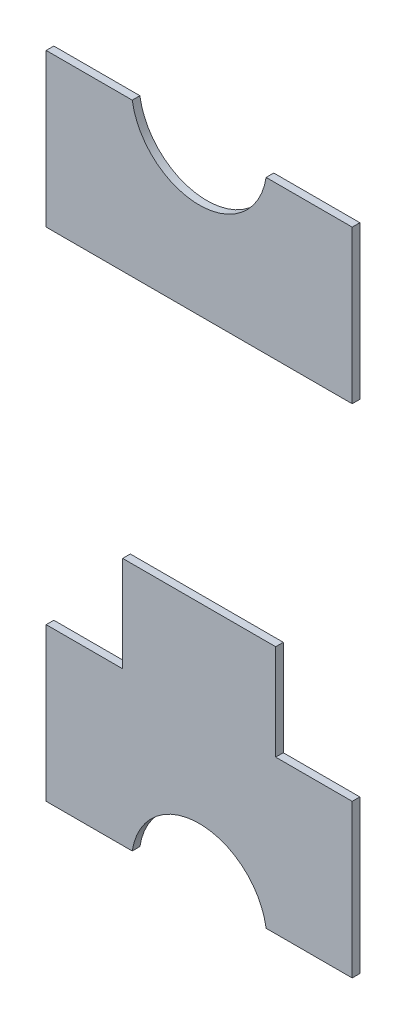
ISO-10303-21;
HEADER;
FILE_DESCRIPTION(('STEP AP214'),'2;1');
FILE_NAME('part.step','',(''),(''),'','','');
FILE_SCHEMA(('AUTOMOTIVE_DESIGN { 1 0 10303 214 1 1 1 1 }'));
ENDSEC;
DATA;
#1=APPLICATION_CONTEXT('core data for automotive mechanical design processes');
#2=APPLICATION_PROTOCOL_DEFINITION('international standard','automotive_design',2000,#1);
#3=PRODUCT_CONTEXT('',#1,'mechanical');
#4=PRODUCT('Part','Part','',(#3));
#5=PRODUCT_RELATED_PRODUCT_CATEGORY('part','',(#4));
#6=PRODUCT_DEFINITION_FORMATION('','',#4);
#7=PRODUCT_DEFINITION_CONTEXT('part definition',#1,'design');
#8=PRODUCT_DEFINITION('design','',#6,#7);
#9=PRODUCT_DEFINITION_SHAPE('','',#8);
#10=(LENGTH_UNIT() NAMED_UNIT(*) SI_UNIT(.MILLI.,.METRE.));
#11=(NAMED_UNIT(*) PLANE_ANGLE_UNIT() SI_UNIT($,.RADIAN.));
#12=(NAMED_UNIT(*) SI_UNIT($,.STERADIAN.) SOLID_ANGLE_UNIT());
#13=UNCERTAINTY_MEASURE_WITH_UNIT(LENGTH_MEASURE(1.E-05),#10,'distance_accuracy_value','');
#14=(GEOMETRIC_REPRESENTATION_CONTEXT(3) GLOBAL_UNCERTAINTY_ASSIGNED_CONTEXT((#13)) GLOBAL_UNIT_ASSIGNED_CONTEXT((#10,
#11,#12)) REPRESENTATION_CONTEXT('',''));
#15=CARTESIAN_POINT('',(0.,0.,0.));
#16=DIRECTION('',(0.,0.,1.));
#17=DIRECTION('',(1.,0.,0.));
#18=AXIS2_PLACEMENT_3D('',#15,#16,#17);
#19=CARTESIAN_POINT('',(-0.4,-0.85,0.01999999955297));
#20=DIRECTION('',(0.,0.,1.));
#21=DIRECTION('',(1.,0.,0.));
#22=AXIS2_PLACEMENT_3D('',#19,#20,#21);
#23=PLANE('',#22);
#24=DIRECTION('',(1.,0.,0.));
#25=VECTOR('',#24,1.);
#26=CARTESIAN_POINT('',(-0.2,-0.2,0.01999999955297));
#27=LINE('',#26,#25);
#28=CARTESIAN_POINT('',(-0.2,-0.2,0.01999999955297));
#29=VERTEX_POINT('',#28);
#30=CARTESIAN_POINT('',(0.2,-0.2,0.01999999955297));
#31=VERTEX_POINT('',#30);
#32=EDGE_CURVE('P0_E179',#29,#31,#27,.T.);
#33=ORIENTED_EDGE('',*,*,#32,.F.);
#34=DIRECTION('',(0.,1.,0.));
#35=VECTOR('',#34,1.);
#36=CARTESIAN_POINT('',(-0.2,-0.45,0.01999999955297));
#37=LINE('',#36,#35);
#38=CARTESIAN_POINT('',(-0.2,-0.45,0.01999999955297));
#39=VERTEX_POINT('',#38);
#40=EDGE_CURVE('P0_E172',#39,#29,#37,.T.);
#41=ORIENTED_EDGE('',*,*,#40,.F.);
#42=DIRECTION('',(1.,0.,0.));
#43=VECTOR('',#42,1.);
#44=CARTESIAN_POINT('',(-0.4,-0.45,0.01999999955297));
#45=LINE('',#44,#43);
#46=CARTESIAN_POINT('',(-0.4,-0.45,0.01999999955297));
#47=VERTEX_POINT('',#46);
#48=EDGE_CURVE('P0_E138',#47,#39,#45,.T.);
#49=ORIENTED_EDGE('',*,*,#48,.F.);
#50=DIRECTION('',(0.,1.,0.));
#51=VECTOR('',#50,1.);
#52=CARTESIAN_POINT('',(-0.4,-0.85,0.01999999955297));
#53=LINE('',#52,#51);
#54=CARTESIAN_POINT('',(-0.4,-0.85,0.01999999955297));
#55=VERTEX_POINT('',#54);
#56=EDGE_CURVE('P0_E131',#55,#47,#53,.T.);
#57=ORIENTED_EDGE('',*,*,#56,.F.);
#58=DIRECTION('',(1.,0.,0.));
#59=VECTOR('',#58,1.);
#60=CARTESIAN_POINT('',(-0.175,-0.85,0.01999999955297));
#61=LINE('',#60,#59);
#62=CARTESIAN_POINT('',(-0.174999999999718,-0.850000000000022,0.01999999955297));
#63=VERTEX_POINT('',#62);
#64=EDGE_CURVE('P0_E97',#63,#55,#61,.F.);
#65=ORIENTED_EDGE('',*,*,#64,.F.);
#66=CARTESIAN_POINT('',(0.,-0.877083333333,0.01999999955297));
#67=DIRECTION('',(0.,0.,-1.));
#68=DIRECTION('',(-1.,0.,0.));
#69=AXIS2_PLACEMENT_3D('',#66,#67,#68);
#70=CIRCLE('',#69,0.177083333333);
#71=CARTESIAN_POINT('',(0.174999999999857,-0.85,0.01999999955297));
#72=VERTEX_POINT('',#71);
#73=EDGE_CURVE('P0_E20',#63,#72,#70,.T.);
#74=ORIENTED_EDGE('',*,*,#73,.T.);
#75=DIRECTION('',(1.,0.,0.));
#76=VECTOR('',#75,1.);
#77=CARTESIAN_POINT('',(0.4,-0.85,0.01999999955297));
#78=LINE('',#77,#76);
#79=CARTESIAN_POINT('',(0.4,-0.85,0.01999999955297));
#80=VERTEX_POINT('',#79);
#81=EDGE_CURVE('P0_E94',#80,#72,#78,.F.);
#82=ORIENTED_EDGE('',*,*,#81,.F.);
#83=DIRECTION('',(0.,1.,0.));
#84=VECTOR('',#83,1.);
#85=CARTESIAN_POINT('',(0.4,-0.45,0.01999999955297));
#86=LINE('',#85,#84);
#87=CARTESIAN_POINT('',(0.4,-0.45,0.01999999955297));
#88=VERTEX_POINT('',#87);
#89=EDGE_CURVE('P0_E126',#88,#80,#86,.F.);
#90=ORIENTED_EDGE('',*,*,#89,.F.);
#91=DIRECTION('',(1.,0.,0.));
#92=VECTOR('',#91,1.);
#93=CARTESIAN_POINT('',(0.2,-0.45,0.01999999955297));
#94=LINE('',#93,#92);
#95=CARTESIAN_POINT('',(0.2,-0.45,0.01999999955297));
#96=VERTEX_POINT('',#95);
#97=EDGE_CURVE('P0_E185',#96,#88,#94,.T.);
#98=ORIENTED_EDGE('',*,*,#97,.F.);
#99=DIRECTION('',(0.,1.,0.));
#100=VECTOR('',#99,1.);
#101=CARTESIAN_POINT('',(0.2,-0.2,0.01999999955297));
#102=LINE('',#101,#100);
#103=EDGE_CURVE('P0_E181',#31,#96,#102,.F.);
#104=ORIENTED_EDGE('',*,*,#103,.F.);
#105=EDGE_LOOP('',(#33,#41,#49,#57,#65,#74,#82,#90,#98,#104));
#106=FACE_BOUND('',#105,.T.);
#107=ADVANCED_FACE('P0_F17',(#106),#23,.T.);
#108=CARTESIAN_POINT('',(-0.4,-0.85,0.));
#109=DIRECTION('',(-1.,0.,0.));
#110=DIRECTION('',(0.,0.,1.));
#111=AXIS2_PLACEMENT_3D('',#108,#109,#110);
#112=PLANE('',#111);
#113=DIRECTION('',(0.,0.,-1.));
#114=VECTOR('',#113,1.);
#115=CARTESIAN_POINT('',(-0.4,-0.85,0.));
#116=LINE('',#115,#114);
#117=CARTESIAN_POINT('',(-0.4,-0.85,0.));
#118=VERTEX_POINT('',#117);
#119=EDGE_CURVE('P0_E129',#55,#118,#116,.T.);
#120=ORIENTED_EDGE('',*,*,#119,.F.);
#121=ORIENTED_EDGE('',*,*,#56,.T.);
#122=DIRECTION('',(0.,0.,1.));
#123=VECTOR('',#122,1.);
#124=CARTESIAN_POINT('',(-0.4,-0.45,0.));
#125=LINE('',#124,#123);
#126=CARTESIAN_POINT('',(-0.4,-0.45,0.));
#127=VERTEX_POINT('',#126);
#128=EDGE_CURVE('P0_E141',#127,#47,#125,.T.);
#129=ORIENTED_EDGE('',*,*,#128,.F.);
#130=DIRECTION('',(0.,1.,0.));
#131=VECTOR('',#130,1.);
#132=CARTESIAN_POINT('',(-0.4,-0.85,0.));
#133=LINE('',#132,#131);
#134=EDGE_CURVE('P0_E134',#127,#118,#133,.F.);
#135=ORIENTED_EDGE('',*,*,#134,.T.);
#136=EDGE_LOOP('',(#120,#121,#129,#135));
#137=FACE_BOUND('',#136,.T.);
#138=ADVANCED_FACE('P0_F224',(#137),#112,.T.);
#139=CARTESIAN_POINT('',(-0.175,-0.85,0.));
#140=DIRECTION('',(0.,-1.,0.));
#141=DIRECTION('',(0.,0.,-1.));
#142=AXIS2_PLACEMENT_3D('',#139,#140,#141);
#143=PLANE('',#142);
#144=DIRECTION('',(0.,0.,-1.));
#145=VECTOR('',#144,1.);
#146=CARTESIAN_POINT('',(-0.174999999999721,-0.850000000000043,0.));
#147=LINE('',#146,#145);
#148=CARTESIAN_POINT('',(-0.174999999999718,-0.850000000000022,0.));
#149=VERTEX_POINT('',#148);
#150=EDGE_CURVE('P0_E99',#149,#63,#147,.F.);
#151=ORIENTED_EDGE('',*,*,#150,.T.);
#152=ORIENTED_EDGE('',*,*,#64,.T.);
#153=ORIENTED_EDGE('',*,*,#119,.T.);
#154=DIRECTION('',(1.,0.,0.));
#155=VECTOR('',#154,1.);
#156=CARTESIAN_POINT('',(-0.4,-0.85,0.));
#157=LINE('',#156,#155);
#158=EDGE_CURVE('P0_E137',#118,#149,#157,.T.);
#159=ORIENTED_EDGE('',*,*,#158,.T.);
#160=EDGE_LOOP('',(#151,#152,#153,#159));
#161=FACE_BOUND('',#160,.T.);
#162=ADVANCED_FACE('P0_F225',(#161),#143,.T.);
#163=CARTESIAN_POINT('',(0.,-0.877083333333,0.));
#164=DIRECTION('',(0.,0.,-1.));
#165=DIRECTION('',(-1.,0.,0.));
#166=AXIS2_PLACEMENT_3D('',#163,#164,#165);
#167=CYLINDRICAL_SURFACE('',#166,0.177083333333);
#168=CARTESIAN_POINT('',(0.,-0.877083333333,0.));
#169=DIRECTION('',(0.,0.,-1.));
#170=DIRECTION('',(-1.,0.,0.));
#171=AXIS2_PLACEMENT_3D('',#168,#169,#170);
#172=CIRCLE('',#171,0.177083333333);
#173=CARTESIAN_POINT('',(0.174999999999857,-0.85,0.));
#174=VERTEX_POINT('',#173);
#175=EDGE_CURVE('P0_E111',#149,#174,#172,.T.);
#176=ORIENTED_EDGE('',*,*,#175,.T.);
#177=DIRECTION('',(0.,0.,-1.));
#178=VECTOR('',#177,1.);
#179=CARTESIAN_POINT('',(0.175,-0.85,0.));
#180=LINE('',#179,#178);
#181=EDGE_CURVE('P0_E104',#72,#174,#180,.T.);
#182=ORIENTED_EDGE('',*,*,#181,.F.);
#183=ORIENTED_EDGE('',*,*,#73,.F.);
#184=ORIENTED_EDGE('',*,*,#150,.F.);
#185=EDGE_LOOP('',(#176,#182,#183,#184));
#186=FACE_BOUND('',#185,.T.);
#187=ADVANCED_FACE('P0_F109',(#186),#167,.F.);
#188=CARTESIAN_POINT('',(0.4,-0.85,0.));
#189=DIRECTION('',(0.,-1.,0.));
#190=DIRECTION('',(0.,0.,-1.));
#191=AXIS2_PLACEMENT_3D('',#188,#189,#190);
#192=PLANE('',#191);
#193=DIRECTION('',(0.,0.,-1.));
#194=VECTOR('',#193,1.);
#195=CARTESIAN_POINT('',(0.4,-0.85,0.));
#196=LINE('',#195,#194);
#197=CARTESIAN_POINT('',(0.4,-0.85,0.));
#198=VERTEX_POINT('',#197);
#199=EDGE_CURVE('P0_E106',#80,#198,#196,.T.);
#200=ORIENTED_EDGE('',*,*,#199,.F.);
#201=ORIENTED_EDGE('',*,*,#81,.T.);
#202=ORIENTED_EDGE('',*,*,#181,.T.);
#203=DIRECTION('',(1.,0.,0.));
#204=VECTOR('',#203,1.);
#205=CARTESIAN_POINT('',(-0.4,-0.85,0.));
#206=LINE('',#205,#204);
#207=EDGE_CURVE('P0_E122',#174,#198,#206,.T.);
#208=ORIENTED_EDGE('',*,*,#207,.T.);
#209=EDGE_LOOP('',(#200,#201,#202,#208));
#210=FACE_BOUND('',#209,.T.);
#211=ADVANCED_FACE('P0_F102',(#210),#192,.T.);
#212=CARTESIAN_POINT('',(0.4,-0.45,0.));
#213=DIRECTION('',(1.,0.,0.));
#214=DIRECTION('',(0.,0.,-1.));
#215=AXIS2_PLACEMENT_3D('',#212,#213,#214);
#216=PLANE('',#215);
#217=DIRECTION('',(0.,0.,1.));
#218=VECTOR('',#217,1.);
#219=CARTESIAN_POINT('',(0.4,-0.45,0.));
#220=LINE('',#219,#218);
#221=CARTESIAN_POINT('',(0.4,-0.45,0.));
#222=VERTEX_POINT('',#221);
#223=EDGE_CURVE('P0_E116',#88,#222,#220,.F.);
#224=ORIENTED_EDGE('',*,*,#223,.F.);
#225=ORIENTED_EDGE('',*,*,#89,.T.);
#226=ORIENTED_EDGE('',*,*,#199,.T.);
#227=DIRECTION('',(0.,1.,0.));
#228=VECTOR('',#227,1.);
#229=CARTESIAN_POINT('',(0.4,-0.85,0.));
#230=LINE('',#229,#228);
#231=EDGE_CURVE('P0_E118',#198,#222,#230,.T.);
#232=ORIENTED_EDGE('',*,*,#231,.T.);
#233=EDGE_LOOP('',(#224,#225,#226,#232));
#234=FACE_BOUND('',#233,.T.);
#235=ADVANCED_FACE('P0_F203',(#234),#216,.T.);
#236=CARTESIAN_POINT('',(0.2,-0.45,0.));
#237=DIRECTION('',(0.,1.,0.));
#238=DIRECTION('',(0.,0.,1.));
#239=AXIS2_PLACEMENT_3D('',#236,#237,#238);
#240=PLANE('',#239);
#241=DIRECTION('',(0.,0.,-1.));
#242=VECTOR('',#241,1.);
#243=CARTESIAN_POINT('',(0.2,-0.45,0.));
#244=LINE('',#243,#242);
#245=CARTESIAN_POINT('',(0.2,-0.45,0.));
#246=VERTEX_POINT('',#245);
#247=EDGE_CURVE('P0_E184',#96,#246,#244,.T.);
#248=ORIENTED_EDGE('',*,*,#247,.F.);
#249=ORIENTED_EDGE('',*,*,#97,.T.);
#250=ORIENTED_EDGE('',*,*,#223,.T.);
#251=DIRECTION('',(1.,0.,0.));
#252=VECTOR('',#251,1.);
#253=CARTESIAN_POINT('',(-0.4,-0.45,0.));
#254=LINE('',#253,#252);
#255=EDGE_CURVE('P0_E121',#222,#246,#254,.F.);
#256=ORIENTED_EDGE('',*,*,#255,.T.);
#257=EDGE_LOOP('',(#248,#249,#250,#256));
#258=FACE_BOUND('',#257,.T.);
#259=ADVANCED_FACE('P0_F192',(#258),#240,.T.);
#260=CARTESIAN_POINT('',(0.2,-0.2,0.));
#261=DIRECTION('',(1.,0.,0.));
#262=DIRECTION('',(0.,0.,-1.));
#263=AXIS2_PLACEMENT_3D('',#260,#261,#262);
#264=PLANE('',#263);
#265=DIRECTION('',(0.,0.,1.));
#266=VECTOR('',#265,1.);
#267=CARTESIAN_POINT('',(0.2,-0.2,0.));
#268=LINE('',#267,#266);
#269=CARTESIAN_POINT('',(0.2,-0.2,0.));
#270=VERTEX_POINT('',#269);
#271=EDGE_CURVE('P0_E177',#31,#270,#268,.F.);
#272=ORIENTED_EDGE('',*,*,#271,.F.);
#273=ORIENTED_EDGE('',*,*,#103,.T.);
#274=ORIENTED_EDGE('',*,*,#247,.T.);
#275=DIRECTION('',(0.,1.,0.));
#276=VECTOR('',#275,1.);
#277=CARTESIAN_POINT('',(0.2,-0.85,0.));
#278=LINE('',#277,#276);
#279=EDGE_CURVE('P0_E201',#246,#270,#278,.T.);
#280=ORIENTED_EDGE('',*,*,#279,.T.);
#281=EDGE_LOOP('',(#272,#273,#274,#280));
#282=FACE_BOUND('',#281,.T.);
#283=ADVANCED_FACE('P0_F207',(#282),#264,.T.);
#284=CARTESIAN_POINT('',(-0.2,-0.2,0.));
#285=DIRECTION('',(0.,1.,0.));
#286=DIRECTION('',(0.,0.,1.));
#287=AXIS2_PLACEMENT_3D('',#284,#285,#286);
#288=PLANE('',#287);
#289=DIRECTION('',(1.,0.,0.));
#290=VECTOR('',#289,1.);
#291=CARTESIAN_POINT('',(-0.4,-0.2,0.));
#292=LINE('',#291,#290);
#293=CARTESIAN_POINT('',(-0.2,-0.2,0.));
#294=VERTEX_POINT('',#293);
#295=EDGE_CURVE('P0_E212',#270,#294,#292,.F.);
#296=ORIENTED_EDGE('',*,*,#295,.T.);
#297=DIRECTION('',(0.,0.,1.));
#298=VECTOR('',#297,1.);
#299=CARTESIAN_POINT('',(-0.2,-0.2,0.));
#300=LINE('',#299,#298);
#301=EDGE_CURVE('P0_E175',#29,#294,#300,.F.);
#302=ORIENTED_EDGE('',*,*,#301,.F.);
#303=ORIENTED_EDGE('',*,*,#32,.T.);
#304=ORIENTED_EDGE('',*,*,#271,.T.);
#305=EDGE_LOOP('',(#296,#302,#303,#304));
#306=FACE_BOUND('',#305,.T.);
#307=ADVANCED_FACE('P0_F210',(#306),#288,.T.);
#308=CARTESIAN_POINT('',(-0.2,-0.45,0.));
#309=DIRECTION('',(-1.,0.,0.));
#310=DIRECTION('',(0.,0.,1.));
#311=AXIS2_PLACEMENT_3D('',#308,#309,#310);
#312=PLANE('',#311);
#313=DIRECTION('',(0.,0.,1.));
#314=VECTOR('',#313,1.);
#315=CARTESIAN_POINT('',(-0.2,-0.45,0.));
#316=LINE('',#315,#314);
#317=CARTESIAN_POINT('',(-0.2,-0.45,0.));
#318=VERTEX_POINT('',#317);
#319=EDGE_CURVE('P0_E34',#39,#318,#316,.F.);
#320=ORIENTED_EDGE('',*,*,#319,.F.);
#321=ORIENTED_EDGE('',*,*,#40,.T.);
#322=ORIENTED_EDGE('',*,*,#301,.T.);
#323=DIRECTION('',(0.,1.,0.));
#324=VECTOR('',#323,1.);
#325=CARTESIAN_POINT('',(-0.2,-0.85,0.));
#326=LINE('',#325,#324);
#327=EDGE_CURVE('P0_E26',#294,#318,#326,.F.);
#328=ORIENTED_EDGE('',*,*,#327,.T.);
#329=EDGE_LOOP('',(#320,#321,#322,#328));
#330=FACE_BOUND('',#329,.T.);
#331=ADVANCED_FACE('P0_F218',(#330),#312,.T.);
#332=CARTESIAN_POINT('',(-0.4,-0.45,0.));
#333=DIRECTION('',(0.,1.,0.));
#334=DIRECTION('',(0.,0.,1.));
#335=AXIS2_PLACEMENT_3D('',#332,#333,#334);
#336=PLANE('',#335);
#337=ORIENTED_EDGE('',*,*,#128,.T.);
#338=ORIENTED_EDGE('',*,*,#48,.T.);
#339=ORIENTED_EDGE('',*,*,#319,.T.);
#340=DIRECTION('',(1.,0.,0.));
#341=VECTOR('',#340,1.);
#342=CARTESIAN_POINT('',(-0.4,-0.45,0.));
#343=LINE('',#342,#341);
#344=EDGE_CURVE('P0_E11',#318,#127,#343,.F.);
#345=ORIENTED_EDGE('',*,*,#344,.T.);
#346=EDGE_LOOP('',(#337,#338,#339,#345));
#347=FACE_BOUND('',#346,.T.);
#348=ADVANCED_FACE('P0_F220',(#347),#336,.T.);
#349=CARTESIAN_POINT('',(-0.4,-0.85,0.));
#350=DIRECTION('',(0.,0.,1.));
#351=DIRECTION('',(1.,0.,0.));
#352=AXIS2_PLACEMENT_3D('',#349,#350,#351);
#353=PLANE('',#352);
#354=ORIENTED_EDGE('',*,*,#327,.F.);
#355=ORIENTED_EDGE('',*,*,#295,.F.);
#356=ORIENTED_EDGE('',*,*,#279,.F.);
#357=ORIENTED_EDGE('',*,*,#255,.F.);
#358=ORIENTED_EDGE('',*,*,#231,.F.);
#359=ORIENTED_EDGE('',*,*,#207,.F.);
#360=ORIENTED_EDGE('',*,*,#175,.F.);
#361=ORIENTED_EDGE('',*,*,#158,.F.);
#362=ORIENTED_EDGE('',*,*,#134,.F.);
#363=ORIENTED_EDGE('',*,*,#344,.F.);
#364=EDGE_LOOP('',(#354,#355,#356,#357,#358,#359,#360,#361,#362,#363));
#365=FACE_BOUND('',#364,.T.);
#366=ADVANCED_FACE('P0_F198',(#365),#353,.F.);
#367=CLOSED_SHELL('',(#107,#138,#162,#187,#211,#235,#259,#283,#307,#331,#348,#366));
#368=MANIFOLD_SOLID_BREP('P0_B1',#367);
#369=CARTESIAN_POINT('',(-0.175,0.85,0.));
#370=DIRECTION('',(0.,0.,-1.));
#371=DIRECTION('',(-1.,0.,0.));
#372=AXIS2_PLACEMENT_3D('',#369,#370,#371);
#373=PLANE('',#372);
#374=DIRECTION('',(0.,1.,0.));
#375=VECTOR('',#374,1.);
#376=CARTESIAN_POINT('',(0.4,0.45,0.));
#377=LINE('',#376,#375);
#378=CARTESIAN_POINT('',(0.4,0.85,0.));
#379=VERTEX_POINT('',#378);
#380=CARTESIAN_POINT('',(0.4,0.45,0.));
#381=VERTEX_POINT('',#380);
#382=EDGE_CURVE('P1_E88',#379,#381,#377,.F.);
#383=ORIENTED_EDGE('',*,*,#382,.T.);
#384=DIRECTION('',(1.,0.,0.));
#385=VECTOR('',#384,1.);
#386=CARTESIAN_POINT('',(-0.4,0.45,0.));
#387=LINE('',#386,#385);
#388=CARTESIAN_POINT('',(-0.4,0.45,0.));
#389=VERTEX_POINT('',#388);
#390=EDGE_CURVE('P1_E102',#381,#389,#387,.F.);
#391=ORIENTED_EDGE('',*,*,#390,.T.);
#392=DIRECTION('',(0.,1.,0.));
#393=VECTOR('',#392,1.);
#394=CARTESIAN_POINT('',(-0.4,0.85,0.));
#395=LINE('',#394,#393);
#396=CARTESIAN_POINT('',(-0.4,0.85,0.));
#397=VERTEX_POINT('',#396);
#398=EDGE_CURVE('P1_E109',#389,#397,#395,.T.);
#399=ORIENTED_EDGE('',*,*,#398,.T.);
#400=DIRECTION('',(1.,0.,0.));
#401=VECTOR('',#400,1.);
#402=CARTESIAN_POINT('',(-0.175,0.85,0.));
#403=LINE('',#402,#401);
#404=CARTESIAN_POINT('',(-0.174999999999718,0.850000000000022,0.));
#405=VERTEX_POINT('',#404);
#406=EDGE_CURVE('P1_E66',#397,#405,#403,.T.);
#407=ORIENTED_EDGE('',*,*,#406,.T.);
#408=CARTESIAN_POINT('',(0.,0.877083333333,0.));
#409=DIRECTION('',(0.,0.,-1.));
#410=DIRECTION('',(-1.,0.,0.));
#411=AXIS2_PLACEMENT_3D('',#408,#409,#410);
#412=CIRCLE('',#411,0.177083333333);
#413=CARTESIAN_POINT('',(0.174999999999857,0.85,0.));
#414=VERTEX_POINT('',#413);
#415=EDGE_CURVE('P1_E20',#405,#414,#412,.F.);
#416=ORIENTED_EDGE('',*,*,#415,.T.);
#417=DIRECTION('',(1.,0.,0.));
#418=VECTOR('',#417,1.);
#419=CARTESIAN_POINT('',(0.4,0.85,0.));
#420=LINE('',#419,#418);
#421=EDGE_CURVE('P1_E72',#414,#379,#420,.T.);
#422=ORIENTED_EDGE('',*,*,#421,.T.);
#423=EDGE_LOOP('',(#383,#391,#399,#407,#416,#422));
#424=FACE_BOUND('',#423,.T.);
#425=ADVANCED_FACE('P1_F17',(#424),#373,.T.);
#426=CARTESIAN_POINT('',(-0.175,0.85,0.));
#427=DIRECTION('',(0.,-1.,0.));
#428=DIRECTION('',(0.,0.,-1.));
#429=AXIS2_PLACEMENT_3D('',#426,#427,#428);
#430=PLANE('',#429);
#431=DIRECTION('',(-1.,0.,0.));
#432=VECTOR('',#431,1.);
#433=CARTESIAN_POINT('',(-0.175,0.85,0.01999999955297));
#434=LINE('',#433,#432);
#435=CARTESIAN_POINT('',(-0.4,0.85,0.01999999955297));
#436=VERTEX_POINT('',#435);
#437=CARTESIAN_POINT('',(-0.174999999999718,0.850000000000022,0.01999999955297));
#438=VERTEX_POINT('',#437);
#439=EDGE_CURVE('P1_E126',#436,#438,#434,.F.);
#440=ORIENTED_EDGE('',*,*,#439,.T.);
#441=DIRECTION('',(0.,0.,-1.));
#442=VECTOR('',#441,1.);
#443=CARTESIAN_POINT('',(-0.174999999999721,0.850000000000043,0.));
#444=LINE('',#443,#442);
#445=EDGE_CURVE('P1_E83',#438,#405,#444,.T.);
#446=ORIENTED_EDGE('',*,*,#445,.T.);
#447=ORIENTED_EDGE('',*,*,#406,.F.);
#448=DIRECTION('',(0.,0.,-1.));
#449=VECTOR('',#448,1.);
#450=CARTESIAN_POINT('',(-0.4,0.85,0.));
#451=LINE('',#450,#449);
#452=EDGE_CURVE('P1_E106',#397,#436,#451,.F.);
#453=ORIENTED_EDGE('',*,*,#452,.T.);
#454=EDGE_LOOP('',(#440,#446,#447,#453));
#455=FACE_BOUND('',#454,.T.);
#456=ADVANCED_FACE('P1_F153',(#455),#430,.F.);
#457=CARTESIAN_POINT('',(0.,0.877083333333,0.));
#458=DIRECTION('',(0.,0.,-1.));
#459=DIRECTION('',(-1.,0.,0.));
#460=AXIS2_PLACEMENT_3D('',#457,#458,#459);
#461=CYLINDRICAL_SURFACE('',#460,0.177083333333);
#462=ORIENTED_EDGE('',*,*,#415,.F.);
#463=ORIENTED_EDGE('',*,*,#445,.F.);
#464=CARTESIAN_POINT('',(0.,0.877083333333,0.01999999955297));
#465=DIRECTION('',(0.,0.,-1.));
#466=DIRECTION('',(-1.,0.,0.));
#467=AXIS2_PLACEMENT_3D('',#464,#465,#466);
#468=CIRCLE('',#467,0.177083333333);
#469=CARTESIAN_POINT('',(0.174999999999857,0.85,0.01999999955297));
#470=VERTEX_POINT('',#469);
#471=EDGE_CURVE('P1_E87',#438,#470,#468,.F.);
#472=ORIENTED_EDGE('',*,*,#471,.T.);
#473=DIRECTION('',(0.,0.,-1.));
#474=VECTOR('',#473,1.);
#475=CARTESIAN_POINT('',(0.175,0.85,0.));
#476=LINE('',#475,#474);
#477=EDGE_CURVE('P1_E76',#470,#414,#476,.T.);
#478=ORIENTED_EDGE('',*,*,#477,.T.);
#479=EDGE_LOOP('',(#462,#463,#472,#478));
#480=FACE_BOUND('',#479,.T.);
#481=ADVANCED_FACE('P1_F85',(#480),#461,.F.);
#482=CARTESIAN_POINT('',(0.4,0.85,0.));
#483=DIRECTION('',(0.,-1.,0.));
#484=DIRECTION('',(0.,0.,-1.));
#485=AXIS2_PLACEMENT_3D('',#482,#483,#484);
#486=PLANE('',#485);
#487=DIRECTION('',(-1.,0.,0.));
#488=VECTOR('',#487,1.);
#489=CARTESIAN_POINT('',(-0.175,0.85,0.01999999955297));
#490=LINE('',#489,#488);
#491=CARTESIAN_POINT('',(0.4,0.85,0.01999999955297));
#492=VERTEX_POINT('',#491);
#493=EDGE_CURVE('P1_E98',#470,#492,#490,.F.);
#494=ORIENTED_EDGE('',*,*,#493,.T.);
#495=DIRECTION('',(0.,0.,1.));
#496=VECTOR('',#495,1.);
#497=CARTESIAN_POINT('',(0.4,0.85,0.));
#498=LINE('',#497,#496);
#499=EDGE_CURVE('P1_E78',#492,#379,#498,.F.);
#500=ORIENTED_EDGE('',*,*,#499,.T.);
#501=ORIENTED_EDGE('',*,*,#421,.F.);
#502=ORIENTED_EDGE('',*,*,#477,.F.);
#503=EDGE_LOOP('',(#494,#500,#501,#502));
#504=FACE_BOUND('',#503,.T.);
#505=ADVANCED_FACE('P1_F74',(#504),#486,.F.);
#506=CARTESIAN_POINT('',(0.4,0.45,0.));
#507=DIRECTION('',(-1.,0.,0.));
#508=DIRECTION('',(0.,0.,1.));
#509=AXIS2_PLACEMENT_3D('',#506,#507,#508);
#510=PLANE('',#509);
#511=DIRECTION('',(0.,1.,0.));
#512=VECTOR('',#511,1.);
#513=CARTESIAN_POINT('',(0.4,0.85,0.01999999955297));
#514=LINE('',#513,#512);
#515=CARTESIAN_POINT('',(0.4,0.45,0.01999999955297));
#516=VERTEX_POINT('',#515);
#517=EDGE_CURVE('P1_E95',#492,#516,#514,.F.);
#518=ORIENTED_EDGE('',*,*,#517,.T.);
#519=DIRECTION('',(0.,0.,1.));
#520=VECTOR('',#519,1.);
#521=CARTESIAN_POINT('',(0.4,0.45,0.));
#522=LINE('',#521,#520);
#523=EDGE_CURVE('P1_E118',#516,#381,#522,.F.);
#524=ORIENTED_EDGE('',*,*,#523,.T.);
#525=ORIENTED_EDGE('',*,*,#382,.F.);
#526=ORIENTED_EDGE('',*,*,#499,.F.);
#527=EDGE_LOOP('',(#518,#524,#525,#526));
#528=FACE_BOUND('',#527,.T.);
#529=ADVANCED_FACE('P1_F150',(#528),#510,.F.);
#530=CARTESIAN_POINT('',(-0.4,0.45,0.));
#531=DIRECTION('',(0.,1.,0.));
#532=DIRECTION('',(0.,0.,1.));
#533=AXIS2_PLACEMENT_3D('',#530,#531,#532);
#534=PLANE('',#533);
#535=DIRECTION('',(-1.,0.,0.));
#536=VECTOR('',#535,1.);
#537=CARTESIAN_POINT('',(-0.175,0.45,0.01999999955297));
#538=LINE('',#537,#536);
#539=CARTESIAN_POINT('',(-0.4,0.45,0.01999999955297));
#540=VERTEX_POINT('',#539);
#541=EDGE_CURVE('P1_E26',#516,#540,#538,.T.);
#542=ORIENTED_EDGE('',*,*,#541,.T.);
#543=DIRECTION('',(0.,0.,-1.));
#544=VECTOR('',#543,1.);
#545=CARTESIAN_POINT('',(-0.4,0.45,0.));
#546=LINE('',#545,#544);
#547=EDGE_CURVE('P1_E34',#540,#389,#546,.T.);
#548=ORIENTED_EDGE('',*,*,#547,.T.);
#549=ORIENTED_EDGE('',*,*,#390,.F.);
#550=ORIENTED_EDGE('',*,*,#523,.F.);
#551=EDGE_LOOP('',(#542,#548,#549,#550));
#552=FACE_BOUND('',#551,.T.);
#553=ADVANCED_FACE('P1_F145',(#552),#534,.F.);
#554=CARTESIAN_POINT('',(-0.4,0.85,0.));
#555=DIRECTION('',(1.,0.,0.));
#556=DIRECTION('',(0.,0.,-1.));
#557=AXIS2_PLACEMENT_3D('',#554,#555,#556);
#558=PLANE('',#557);
#559=DIRECTION('',(0.,1.,0.));
#560=VECTOR('',#559,1.);
#561=CARTESIAN_POINT('',(-0.4,0.85,0.01999999955297));
#562=LINE('',#561,#560);
#563=EDGE_CURVE('P1_E11',#540,#436,#562,.T.);
#564=ORIENTED_EDGE('',*,*,#563,.T.);
#565=ORIENTED_EDGE('',*,*,#452,.F.);
#566=ORIENTED_EDGE('',*,*,#398,.F.);
#567=ORIENTED_EDGE('',*,*,#547,.F.);
#568=EDGE_LOOP('',(#564,#565,#566,#567));
#569=FACE_BOUND('',#568,.T.);
#570=ADVANCED_FACE('P1_F152',(#569),#558,.F.);
#571=CARTESIAN_POINT('',(-0.175,0.85,0.01999999955297));
#572=DIRECTION('',(0.,0.,-1.));
#573=DIRECTION('',(-1.,0.,0.));
#574=AXIS2_PLACEMENT_3D('',#571,#572,#573);
#575=PLANE('',#574);
#576=ORIENTED_EDGE('',*,*,#541,.F.);
#577=ORIENTED_EDGE('',*,*,#517,.F.);
#578=ORIENTED_EDGE('',*,*,#493,.F.);
#579=ORIENTED_EDGE('',*,*,#471,.F.);
#580=ORIENTED_EDGE('',*,*,#439,.F.);
#581=ORIENTED_EDGE('',*,*,#563,.F.);
#582=EDGE_LOOP('',(#576,#577,#578,#579,#580,#581));
#583=FACE_BOUND('',#582,.T.);
#584=ADVANCED_FACE('P1_F148',(#583),#575,.F.);
#585=CLOSED_SHELL('',(#425,#456,#481,#505,#529,#553,#570,#584));
#586=MANIFOLD_SOLID_BREP('P1_B1',#585);
#587=ADVANCED_BREP_SHAPE_REPRESENTATION('',(#18,#368,#586),#14);
#588=SHAPE_DEFINITION_REPRESENTATION(#9,#587);
ENDSEC;
END-ISO-10303-21;
